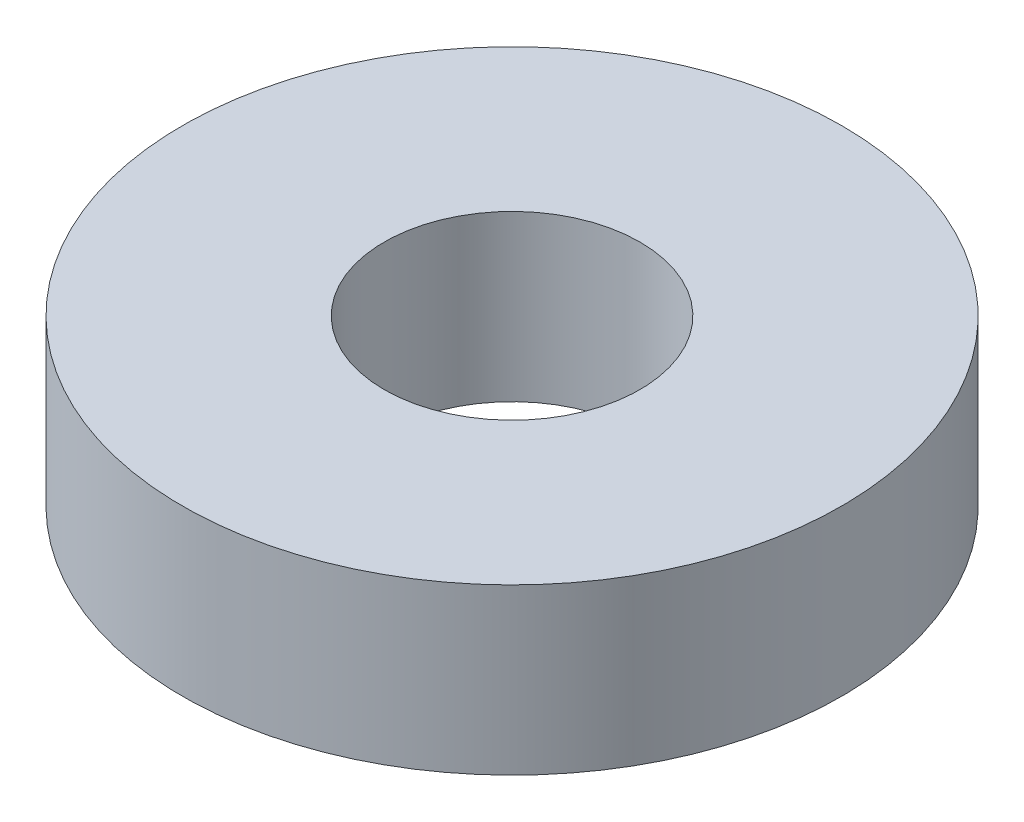
ISO-10303-21;
HEADER;
FILE_DESCRIPTION(('STEP AP214'),'2;1');
FILE_NAME('part.step','',(''),(''),'','','');
FILE_SCHEMA(('AUTOMOTIVE_DESIGN { 1 0 10303 214 1 1 1 1 }'));
ENDSEC;
DATA;
#1=APPLICATION_CONTEXT('core data for automotive mechanical design processes');
#2=APPLICATION_PROTOCOL_DEFINITION('international standard','automotive_design',2000,#1);
#3=PRODUCT_CONTEXT('',#1,'mechanical');
#4=PRODUCT('Part','Part','',(#3));
#5=PRODUCT_RELATED_PRODUCT_CATEGORY('part','',(#4));
#6=PRODUCT_DEFINITION_FORMATION('','',#4);
#7=PRODUCT_DEFINITION_CONTEXT('part definition',#1,'design');
#8=PRODUCT_DEFINITION('design','',#6,#7);
#9=PRODUCT_DEFINITION_SHAPE('','',#8);
#10=(LENGTH_UNIT() NAMED_UNIT(*) SI_UNIT(.MILLI.,.METRE.));
#11=(NAMED_UNIT(*) PLANE_ANGLE_UNIT() SI_UNIT($,.RADIAN.));
#12=(NAMED_UNIT(*) SI_UNIT($,.STERADIAN.) SOLID_ANGLE_UNIT());
#13=UNCERTAINTY_MEASURE_WITH_UNIT(LENGTH_MEASURE(1.E-05),#10,'distance_accuracy_value','');
#14=(GEOMETRIC_REPRESENTATION_CONTEXT(3) GLOBAL_UNCERTAINTY_ASSIGNED_CONTEXT((#13)) GLOBAL_UNIT_ASSIGNED_CONTEXT((#10,
#11,#12)) REPRESENTATION_CONTEXT('',''));
#15=CARTESIAN_POINT('',(0.,0.,0.));
#16=DIRECTION('',(0.,0.,1.));
#17=DIRECTION('',(1.,0.,0.));
#18=AXIS2_PLACEMENT_3D('',#15,#16,#17);
#19=CARTESIAN_POINT('',(0.,-1.5875,0.));
#20=DIRECTION('',(0.,1.,0.));
#21=DIRECTION('',(0.,0.,1.));
#22=AXIS2_PLACEMENT_3D('',#19,#20,#21);
#23=PLANE('',#22);
#24=CARTESIAN_POINT('',(0.,-1.5875,0.));
#25=DIRECTION('',(0.,-1.,0.));
#26=DIRECTION('',(0.,0.,-1.));
#27=AXIS2_PLACEMENT_3D('',#24,#25,#26);
#28=CIRCLE('',#27,2.4638);
#29=CARTESIAN_POINT('',(0.,-1.5875,-2.4638));
#30=VERTEX_POINT('',#29);
#31=EDGE_CURVE('E26',#30,#30,#28,.F.);
#32=ORIENTED_EDGE('',*,*,#31,.T.);
#33=EDGE_LOOP('',(#32));
#34=FACE_BOUND('',#33,.T.);
#35=CARTESIAN_POINT('',(0.,-1.5875,0.));
#36=DIRECTION('',(0.,-1.,0.));
#37=DIRECTION('',(0.,0.,-1.));
#38=AXIS2_PLACEMENT_3D('',#35,#36,#37);
#39=CIRCLE('',#38,6.35);
#40=CARTESIAN_POINT('',(0.,-1.5875,-6.35));
#41=VERTEX_POINT('',#40);
#42=EDGE_CURVE('E17',#41,#41,#39,.F.);
#43=ORIENTED_EDGE('',*,*,#42,.F.);
#44=EDGE_LOOP('',(#43));
#45=FACE_BOUND('',#44,.T.);
#46=ADVANCED_FACE('F14',(#34,#45),#23,.F.);
#47=CARTESIAN_POINT('',(0.,1.5875,0.));
#48=DIRECTION('',(0.,-1.,0.));
#49=DIRECTION('',(0.,0.,-1.));
#50=AXIS2_PLACEMENT_3D('',#47,#48,#49);
#51=CYLINDRICAL_SURFACE('',#50,6.35);
#52=ORIENTED_EDGE('',*,*,#42,.T.);
#53=EDGE_LOOP('',(#52));
#54=FACE_BOUND('',#53,.T.);
#55=CARTESIAN_POINT('',(0.,1.5875,0.));
#56=DIRECTION('',(0.,-1.,0.));
#57=DIRECTION('',(0.,0.,-1.));
#58=AXIS2_PLACEMENT_3D('',#55,#56,#57);
#59=CIRCLE('',#58,6.35);
#60=CARTESIAN_POINT('',(0.,1.5875,-6.35));
#61=VERTEX_POINT('',#60);
#62=EDGE_CURVE('E21',#61,#61,#59,.F.);
#63=ORIENTED_EDGE('',*,*,#62,.F.);
#64=EDGE_LOOP('',(#63));
#65=FACE_BOUND('',#64,.T.);
#66=ADVANCED_FACE('F34',(#54,#65),#51,.T.);
#67=CARTESIAN_POINT('',(0.,1.5875,0.));
#68=DIRECTION('',(0.,-1.,0.));
#69=DIRECTION('',(0.,0.,-1.));
#70=AXIS2_PLACEMENT_3D('',#67,#68,#69);
#71=CYLINDRICAL_SURFACE('',#70,2.4638);
#72=CARTESIAN_POINT('',(0.,1.5875,0.));
#73=DIRECTION('',(0.,-1.,0.));
#74=DIRECTION('',(0.,0.,-1.));
#75=AXIS2_PLACEMENT_3D('',#72,#73,#74);
#76=CIRCLE('',#75,2.4638);
#77=CARTESIAN_POINT('',(0.,1.5875,-2.4638));
#78=VERTEX_POINT('',#77);
#79=EDGE_CURVE('E10',#78,#78,#76,.T.);
#80=ORIENTED_EDGE('',*,*,#79,.F.);
#81=EDGE_LOOP('',(#80));
#82=FACE_BOUND('',#81,.T.);
#83=ORIENTED_EDGE('',*,*,#31,.F.);
#84=EDGE_LOOP('',(#83));
#85=FACE_BOUND('',#84,.T.);
#86=ADVANCED_FACE('F42',(#82,#85),#71,.F.);
#87=CARTESIAN_POINT('',(0.,1.5875,0.));
#88=DIRECTION('',(0.,1.,0.));
#89=DIRECTION('',(0.,0.,1.));
#90=AXIS2_PLACEMENT_3D('',#87,#88,#89);
#91=PLANE('',#90);
#92=ORIENTED_EDGE('',*,*,#79,.T.);
#93=EDGE_LOOP('',(#92));
#94=FACE_BOUND('',#93,.T.);
#95=ORIENTED_EDGE('',*,*,#62,.T.);
#96=EDGE_LOOP('',(#95));
#97=FACE_BOUND('',#96,.T.);
#98=ADVANCED_FACE('F43',(#94,#97),#91,.T.);
#99=CLOSED_SHELL('',(#46,#66,#86,#98));
#100=MANIFOLD_SOLID_BREP('B1',#99);
#101=ADVANCED_BREP_SHAPE_REPRESENTATION('',(#18,#100),#14);
#102=SHAPE_DEFINITION_REPRESENTATION(#9,#101);
ENDSEC;
END-ISO-10303-21;
